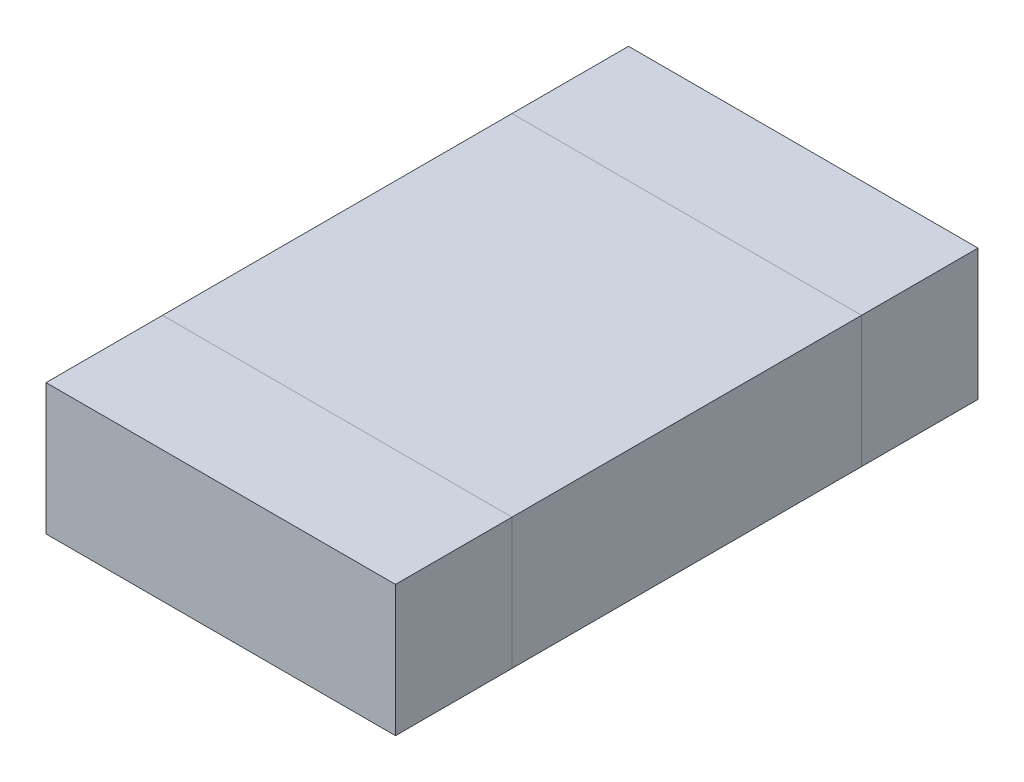
ISO-10303-21;
HEADER;
FILE_DESCRIPTION(('STEP AP214'),'2;1');
FILE_NAME('part.step','',(''),(''),'','','');
FILE_SCHEMA(('AUTOMOTIVE_DESIGN { 1 0 10303 214 1 1 1 1 }'));
ENDSEC;
DATA;
#1=APPLICATION_CONTEXT('core data for automotive mechanical design processes');
#2=APPLICATION_PROTOCOL_DEFINITION('international standard','automotive_design',2000,#1);
#3=PRODUCT_CONTEXT('',#1,'mechanical');
#4=PRODUCT('Part','Part','',(#3));
#5=PRODUCT_RELATED_PRODUCT_CATEGORY('part','',(#4));
#6=PRODUCT_DEFINITION_FORMATION('','',#4);
#7=PRODUCT_DEFINITION_CONTEXT('part definition',#1,'design');
#8=PRODUCT_DEFINITION('design','',#6,#7);
#9=PRODUCT_DEFINITION_SHAPE('','',#8);
#10=(LENGTH_UNIT() NAMED_UNIT(*) SI_UNIT(.MILLI.,.METRE.));
#11=(NAMED_UNIT(*) PLANE_ANGLE_UNIT() SI_UNIT($,.RADIAN.));
#12=(NAMED_UNIT(*) SI_UNIT($,.STERADIAN.) SOLID_ANGLE_UNIT());
#13=UNCERTAINTY_MEASURE_WITH_UNIT(LENGTH_MEASURE(1.E-05),#10,'distance_accuracy_value','');
#14=(GEOMETRIC_REPRESENTATION_CONTEXT(3) GLOBAL_UNCERTAINTY_ASSIGNED_CONTEXT((#13)) GLOBAL_UNIT_ASSIGNED_CONTEXT((#10,
#11,#12)) REPRESENTATION_CONTEXT('',''));
#15=CARTESIAN_POINT('',(0.,0.,0.));
#16=DIRECTION('',(0.,0.,1.));
#17=DIRECTION('',(1.,0.,0.));
#18=AXIS2_PLACEMENT_3D('',#15,#16,#17);
#19=CARTESIAN_POINT('',(-0.6,1.71491106406735,-0.6));
#20=DIRECTION('',(0.,0.,1.));
#21=DIRECTION('',(1.,0.,0.));
#22=AXIS2_PLACEMENT_3D('',#19,#20,#21);
#23=PLANE('',#22);
#24=DIRECTION('',(0.,1.,0.));
#25=VECTOR('',#24,1.);
#26=CARTESIAN_POINT('',(-0.6,1.71491106406735,-0.6));
#27=LINE('',#26,#25);
#28=CARTESIAN_POINT('',(-0.6,0.,-0.6));
#29=VERTEX_POINT('',#28);
#30=CARTESIAN_POINT('',(-0.6,0.45,-0.6));
#31=VERTEX_POINT('',#30);
#32=EDGE_CURVE('P0_E20',#29,#31,#27,.T.);
#33=ORIENTED_EDGE('',*,*,#32,.F.);
#34=DIRECTION('',(1.,0.,0.));
#35=VECTOR('',#34,1.);
#36=CARTESIAN_POINT('',(0.,0.,-0.6));
#37=LINE('',#36,#35);
#38=CARTESIAN_POINT('',(0.6,0.,-0.6));
#39=VERTEX_POINT('',#38);
#40=EDGE_CURVE('P0_E81',#39,#29,#37,.F.);
#41=ORIENTED_EDGE('',*,*,#40,.F.);
#42=DIRECTION('',(0.,1.,0.));
#43=VECTOR('',#42,1.);
#44=CARTESIAN_POINT('',(0.6,1.71491106406735,-0.6));
#45=LINE('',#44,#43);
#46=CARTESIAN_POINT('',(0.6,0.45,-0.6));
#47=VERTEX_POINT('',#46);
#48=EDGE_CURVE('P0_E68',#47,#39,#45,.F.);
#49=ORIENTED_EDGE('',*,*,#48,.F.);
#50=DIRECTION('',(1.,0.,0.));
#51=VECTOR('',#50,1.);
#52=CARTESIAN_POINT('',(0.,0.45,-0.6));
#53=LINE('',#52,#51);
#54=EDGE_CURVE('P0_E55',#31,#47,#53,.T.);
#55=ORIENTED_EDGE('',*,*,#54,.F.);
#56=EDGE_LOOP('',(#33,#41,#49,#55));
#57=FACE_BOUND('',#56,.T.);
#58=ADVANCED_FACE('P0_F17',(#57),#23,.T.);
#59=CARTESIAN_POINT('',(-0.6,1.71491106406735,-0.6));
#60=DIRECTION('',(-1.,0.,0.));
#61=DIRECTION('',(0.,0.,1.));
#62=AXIS2_PLACEMENT_3D('',#59,#60,#61);
#63=PLANE('',#62);
#64=DIRECTION('',(0.,1.,0.));
#65=VECTOR('',#64,1.);
#66=CARTESIAN_POINT('',(-0.6,1.71491106406735,-1.));
#67=LINE('',#66,#65);
#68=CARTESIAN_POINT('',(-0.6,0.,-1.));
#69=VERTEX_POINT('',#68);
#70=CARTESIAN_POINT('',(-0.6,0.45,-1.));
#71=VERTEX_POINT('',#70);
#72=EDGE_CURVE('P0_E83',#69,#71,#67,.T.);
#73=ORIENTED_EDGE('',*,*,#72,.F.);
#74=DIRECTION('',(0.,0.,-1.));
#75=VECTOR('',#74,1.);
#76=CARTESIAN_POINT('',(-0.6,0.,0.));
#77=LINE('',#76,#75);
#78=EDGE_CURVE('P0_E64',#29,#69,#77,.T.);
#79=ORIENTED_EDGE('',*,*,#78,.F.);
#80=ORIENTED_EDGE('',*,*,#32,.T.);
#81=DIRECTION('',(0.,0.,1.));
#82=VECTOR('',#81,1.);
#83=CARTESIAN_POINT('',(-0.6,0.45,0.));
#84=LINE('',#83,#82);
#85=EDGE_CURVE('P0_E61',#71,#31,#84,.T.);
#86=ORIENTED_EDGE('',*,*,#85,.F.);
#87=EDGE_LOOP('',(#73,#79,#80,#86));
#88=FACE_BOUND('',#87,.T.);
#89=ADVANCED_FACE('P0_F60',(#88),#63,.T.);
#90=CARTESIAN_POINT('',(0.,0.45,0.));
#91=DIRECTION('',(0.,1.,0.));
#92=DIRECTION('',(0.,0.,1.));
#93=AXIS2_PLACEMENT_3D('',#90,#91,#92);
#94=PLANE('',#93);
#95=DIRECTION('',(0.,0.,-1.));
#96=VECTOR('',#95,1.);
#97=CARTESIAN_POINT('',(0.6,0.45,-0.6));
#98=LINE('',#97,#96);
#99=CARTESIAN_POINT('',(0.6,0.45,-1.));
#100=VERTEX_POINT('',#99);
#101=EDGE_CURVE('P0_E70',#100,#47,#98,.F.);
#102=ORIENTED_EDGE('',*,*,#101,.F.);
#103=DIRECTION('',(-1.,0.,0.));
#104=VECTOR('',#103,1.);
#105=CARTESIAN_POINT('',(-0.6,0.45,-1.));
#106=LINE('',#105,#104);
#107=EDGE_CURVE('P0_E74',#71,#100,#106,.F.);
#108=ORIENTED_EDGE('',*,*,#107,.F.);
#109=ORIENTED_EDGE('',*,*,#85,.T.);
#110=ORIENTED_EDGE('',*,*,#54,.T.);
#111=EDGE_LOOP('',(#102,#108,#109,#110));
#112=FACE_BOUND('',#111,.T.);
#113=ADVANCED_FACE('P0_F72',(#112),#94,.T.);
#114=CARTESIAN_POINT('',(0.6,1.71491106406735,-0.6));
#115=DIRECTION('',(1.,0.,0.));
#116=DIRECTION('',(0.,0.,-1.));
#117=AXIS2_PLACEMENT_3D('',#114,#115,#116);
#118=PLANE('',#117);
#119=ORIENTED_EDGE('',*,*,#48,.T.);
#120=DIRECTION('',(0.,0.,-1.));
#121=VECTOR('',#120,1.);
#122=CARTESIAN_POINT('',(0.6,0.,0.));
#123=LINE('',#122,#121);
#124=CARTESIAN_POINT('',(0.6,0.,-1.));
#125=VERTEX_POINT('',#124);
#126=EDGE_CURVE('P0_E35',#125,#39,#123,.F.);
#127=ORIENTED_EDGE('',*,*,#126,.F.);
#128=DIRECTION('',(0.,1.,0.));
#129=VECTOR('',#128,1.);
#130=CARTESIAN_POINT('',(0.6,1.71491106406735,-1.));
#131=LINE('',#130,#129);
#132=EDGE_CURVE('P0_E26',#100,#125,#131,.F.);
#133=ORIENTED_EDGE('',*,*,#132,.F.);
#134=ORIENTED_EDGE('',*,*,#101,.T.);
#135=EDGE_LOOP('',(#119,#127,#133,#134));
#136=FACE_BOUND('',#135,.T.);
#137=ADVANCED_FACE('P0_F89',(#136),#118,.T.);
#138=CARTESIAN_POINT('',(0.,0.,0.));
#139=DIRECTION('',(0.,-1.,0.));
#140=DIRECTION('',(0.,0.,-1.));
#141=AXIS2_PLACEMENT_3D('',#138,#139,#140);
#142=PLANE('',#141);
#143=ORIENTED_EDGE('',*,*,#126,.T.);
#144=ORIENTED_EDGE('',*,*,#40,.T.);
#145=ORIENTED_EDGE('',*,*,#78,.T.);
#146=DIRECTION('',(-1.,0.,0.));
#147=VECTOR('',#146,1.);
#148=CARTESIAN_POINT('',(-0.6,0.,-1.));
#149=LINE('',#148,#147);
#150=EDGE_CURVE('P0_E11',#125,#69,#149,.T.);
#151=ORIENTED_EDGE('',*,*,#150,.F.);
#152=EDGE_LOOP('',(#143,#144,#145,#151));
#153=FACE_BOUND('',#152,.T.);
#154=ADVANCED_FACE('P0_F91',(#153),#142,.T.);
#155=CARTESIAN_POINT('',(-0.6,1.71491106406735,-1.));
#156=DIRECTION('',(0.,0.,-1.));
#157=DIRECTION('',(-1.,0.,0.));
#158=AXIS2_PLACEMENT_3D('',#155,#156,#157);
#159=PLANE('',#158);
#160=ORIENTED_EDGE('',*,*,#132,.T.);
#161=ORIENTED_EDGE('',*,*,#150,.T.);
#162=ORIENTED_EDGE('',*,*,#72,.T.);
#163=ORIENTED_EDGE('',*,*,#107,.T.);
#164=EDGE_LOOP('',(#160,#161,#162,#163));
#165=FACE_BOUND('',#164,.T.);
#166=ADVANCED_FACE('P0_F88',(#165),#159,.T.);
#167=CLOSED_SHELL('',(#58,#89,#113,#137,#154,#166));
#168=MANIFOLD_SOLID_BREP('P0_B1',#167);
#169=CARTESIAN_POINT('',(-0.6,1.71491106406735,1.));
#170=DIRECTION('',(0.,0.,1.));
#171=DIRECTION('',(1.,0.,0.));
#172=AXIS2_PLACEMENT_3D('',#169,#170,#171);
#173=PLANE('',#172);
#174=DIRECTION('',(0.,1.,0.));
#175=VECTOR('',#174,1.);
#176=CARTESIAN_POINT('',(-0.6,1.71491106406735,1.));
#177=LINE('',#176,#175);
#178=CARTESIAN_POINT('',(-0.6,0.,1.));
#179=VERTEX_POINT('',#178);
#180=CARTESIAN_POINT('',(-0.6,0.45,1.));
#181=VERTEX_POINT('',#180);
#182=EDGE_CURVE('P1_E20',#179,#181,#177,.T.);
#183=ORIENTED_EDGE('',*,*,#182,.F.);
#184=DIRECTION('',(1.,0.,0.));
#185=VECTOR('',#184,1.);
#186=CARTESIAN_POINT('',(0.,0.,1.));
#187=LINE('',#186,#185);
#188=CARTESIAN_POINT('',(0.6,0.,1.));
#189=VERTEX_POINT('',#188);
#190=EDGE_CURVE('P1_E79',#179,#189,#187,.T.);
#191=ORIENTED_EDGE('',*,*,#190,.T.);
#192=DIRECTION('',(0.,1.,0.));
#193=VECTOR('',#192,1.);
#194=CARTESIAN_POINT('',(0.6,1.71491106406735,1.));
#195=LINE('',#194,#193);
#196=CARTESIAN_POINT('',(0.6,0.45,1.));
#197=VERTEX_POINT('',#196);
#198=EDGE_CURVE('P1_E68',#197,#189,#195,.F.);
#199=ORIENTED_EDGE('',*,*,#198,.F.);
#200=DIRECTION('',(1.,0.,0.));
#201=VECTOR('',#200,1.);
#202=CARTESIAN_POINT('',(0.,0.45,1.));
#203=LINE('',#202,#201);
#204=EDGE_CURVE('P1_E56',#181,#197,#203,.T.);
#205=ORIENTED_EDGE('',*,*,#204,.F.);
#206=EDGE_LOOP('',(#183,#191,#199,#205));
#207=FACE_BOUND('',#206,.T.);
#208=ADVANCED_FACE('P1_F17',(#207),#173,.T.);
#209=CARTESIAN_POINT('',(-0.6,1.71491106406735,0.6));
#210=DIRECTION('',(-1.,0.,0.));
#211=DIRECTION('',(0.,0.,1.));
#212=AXIS2_PLACEMENT_3D('',#209,#210,#211);
#213=PLANE('',#212);
#214=DIRECTION('',(0.,1.,0.));
#215=VECTOR('',#214,1.);
#216=CARTESIAN_POINT('',(-0.6,1.71491106406735,0.6));
#217=LINE('',#216,#215);
#218=CARTESIAN_POINT('',(-0.6,0.,0.6));
#219=VERTEX_POINT('',#218);
#220=CARTESIAN_POINT('',(-0.6,0.45,0.6));
#221=VERTEX_POINT('',#220);
#222=EDGE_CURVE('P1_E83',#219,#221,#217,.T.);
#223=ORIENTED_EDGE('',*,*,#222,.F.);
#224=DIRECTION('',(0.,0.,1.));
#225=VECTOR('',#224,1.);
#226=CARTESIAN_POINT('',(-0.6,0.,0.));
#227=LINE('',#226,#225);
#228=EDGE_CURVE('P1_E65',#219,#179,#227,.T.);
#229=ORIENTED_EDGE('',*,*,#228,.T.);
#230=ORIENTED_EDGE('',*,*,#182,.T.);
#231=DIRECTION('',(0.,0.,1.));
#232=VECTOR('',#231,1.);
#233=CARTESIAN_POINT('',(-0.6,0.45,0.));
#234=LINE('',#233,#232);
#235=EDGE_CURVE('P1_E62',#221,#181,#234,.T.);
#236=ORIENTED_EDGE('',*,*,#235,.F.);
#237=EDGE_LOOP('',(#223,#229,#230,#236));
#238=FACE_BOUND('',#237,.T.);
#239=ADVANCED_FACE('P1_F61',(#238),#213,.T.);
#240=CARTESIAN_POINT('',(0.,0.45,0.));
#241=DIRECTION('',(0.,1.,0.));
#242=DIRECTION('',(0.,0.,1.));
#243=AXIS2_PLACEMENT_3D('',#240,#241,#242);
#244=PLANE('',#243);
#245=DIRECTION('',(0.,0.,-1.));
#246=VECTOR('',#245,1.);
#247=CARTESIAN_POINT('',(0.6,0.45,0.6));
#248=LINE('',#247,#246);
#249=CARTESIAN_POINT('',(0.6,0.45,0.6));
#250=VERTEX_POINT('',#249);
#251=EDGE_CURVE('P1_E70',#250,#197,#248,.F.);
#252=ORIENTED_EDGE('',*,*,#251,.F.);
#253=DIRECTION('',(-1.,0.,0.));
#254=VECTOR('',#253,1.);
#255=CARTESIAN_POINT('',(-0.6,0.45,0.6));
#256=LINE('',#255,#254);
#257=EDGE_CURVE('P1_E74',#221,#250,#256,.F.);
#258=ORIENTED_EDGE('',*,*,#257,.F.);
#259=ORIENTED_EDGE('',*,*,#235,.T.);
#260=ORIENTED_EDGE('',*,*,#204,.T.);
#261=EDGE_LOOP('',(#252,#258,#259,#260));
#262=FACE_BOUND('',#261,.T.);
#263=ADVANCED_FACE('P1_F72',(#262),#244,.T.);
#264=CARTESIAN_POINT('',(0.6,1.71491106406735,0.6));
#265=DIRECTION('',(1.,0.,0.));
#266=DIRECTION('',(0.,0.,-1.));
#267=AXIS2_PLACEMENT_3D('',#264,#265,#266);
#268=PLANE('',#267);
#269=ORIENTED_EDGE('',*,*,#198,.T.);
#270=DIRECTION('',(0.,0.,1.));
#271=VECTOR('',#270,1.);
#272=CARTESIAN_POINT('',(0.6,0.,0.));
#273=LINE('',#272,#271);
#274=CARTESIAN_POINT('',(0.6,0.,0.6));
#275=VERTEX_POINT('',#274);
#276=EDGE_CURVE('P1_E35',#189,#275,#273,.F.);
#277=ORIENTED_EDGE('',*,*,#276,.T.);
#278=DIRECTION('',(0.,1.,0.));
#279=VECTOR('',#278,1.);
#280=CARTESIAN_POINT('',(0.6,1.71491106406735,0.6));
#281=LINE('',#280,#279);
#282=EDGE_CURVE('P1_E26',#250,#275,#281,.F.);
#283=ORIENTED_EDGE('',*,*,#282,.F.);
#284=ORIENTED_EDGE('',*,*,#251,.T.);
#285=EDGE_LOOP('',(#269,#277,#283,#284));
#286=FACE_BOUND('',#285,.T.);
#287=ADVANCED_FACE('P1_F89',(#286),#268,.T.);
#288=CARTESIAN_POINT('',(0.,0.,0.));
#289=DIRECTION('',(0.,1.,0.));
#290=DIRECTION('',(0.,0.,1.));
#291=AXIS2_PLACEMENT_3D('',#288,#289,#290);
#292=PLANE('',#291);
#293=DIRECTION('',(-1.,0.,0.));
#294=VECTOR('',#293,1.);
#295=CARTESIAN_POINT('',(-0.6,0.,0.6));
#296=LINE('',#295,#294);
#297=EDGE_CURVE('P1_E11',#275,#219,#296,.T.);
#298=ORIENTED_EDGE('',*,*,#297,.F.);
#299=ORIENTED_EDGE('',*,*,#276,.F.);
#300=ORIENTED_EDGE('',*,*,#190,.F.);
#301=ORIENTED_EDGE('',*,*,#228,.F.);
#302=EDGE_LOOP('',(#298,#299,#300,#301));
#303=FACE_BOUND('',#302,.T.);
#304=ADVANCED_FACE('P1_F91',(#303),#292,.F.);
#305=CARTESIAN_POINT('',(-0.6,1.71491106406735,0.6));
#306=DIRECTION('',(0.,0.,-1.));
#307=DIRECTION('',(-1.,0.,0.));
#308=AXIS2_PLACEMENT_3D('',#305,#306,#307);
#309=PLANE('',#308);
#310=ORIENTED_EDGE('',*,*,#282,.T.);
#311=ORIENTED_EDGE('',*,*,#297,.T.);
#312=ORIENTED_EDGE('',*,*,#222,.T.);
#313=ORIENTED_EDGE('',*,*,#257,.T.);
#314=EDGE_LOOP('',(#310,#311,#312,#313));
#315=FACE_BOUND('',#314,.T.);
#316=ADVANCED_FACE('P1_F88',(#315),#309,.T.);
#317=CLOSED_SHELL('',(#208,#239,#263,#287,#304,#316));
#318=MANIFOLD_SOLID_BREP('P1_B1',#317);
#319=CARTESIAN_POINT('',(0.,0.,0.));
#320=DIRECTION('',(0.,1.,0.));
#321=DIRECTION('',(0.,0.,1.));
#322=AXIS2_PLACEMENT_3D('',#319,#320,#321);
#323=PLANE('',#322);
#324=DIRECTION('',(-1.,0.,0.));
#325=VECTOR('',#324,1.);
#326=CARTESIAN_POINT('',(-0.6,0.,0.6));
#327=LINE('',#326,#325);
#328=CARTESIAN_POINT('',(0.6,0.,0.6));
#329=VERTEX_POINT('',#328);
#330=CARTESIAN_POINT('',(-0.6,0.,0.6));
#331=VERTEX_POINT('',#330);
#332=EDGE_CURVE('P2_E81',#329,#331,#327,.T.);
#333=ORIENTED_EDGE('',*,*,#332,.T.);
#334=DIRECTION('',(0.,0.,-1.));
#335=VECTOR('',#334,1.);
#336=CARTESIAN_POINT('',(-0.6,0.,-0.6));
#337=LINE('',#336,#335);
#338=CARTESIAN_POINT('',(-0.6,0.,-0.6));
#339=VERTEX_POINT('',#338);
#340=EDGE_CURVE('P2_E68',#331,#339,#337,.T.);
#341=ORIENTED_EDGE('',*,*,#340,.T.);
#342=DIRECTION('',(1.,0.,0.));
#343=VECTOR('',#342,1.);
#344=CARTESIAN_POINT('',(-0.6,0.,-0.6));
#345=LINE('',#344,#343);
#346=CARTESIAN_POINT('',(0.6,0.,-0.6));
#347=VERTEX_POINT('',#346);
#348=EDGE_CURVE('P2_E55',#339,#347,#345,.T.);
#349=ORIENTED_EDGE('',*,*,#348,.T.);
#350=DIRECTION('',(0.,0.,1.));
#351=VECTOR('',#350,1.);
#352=CARTESIAN_POINT('',(0.6,0.,-0.6));
#353=LINE('',#352,#351);
#354=EDGE_CURVE('P2_E20',#347,#329,#353,.T.);
#355=ORIENTED_EDGE('',*,*,#354,.T.);
#356=EDGE_LOOP('',(#333,#341,#349,#355));
#357=FACE_BOUND('',#356,.T.);
#358=ADVANCED_FACE('P2_F17',(#357),#323,.F.);
#359=CARTESIAN_POINT('',(0.6,0.45,-0.6));
#360=DIRECTION('',(-1.,0.,0.));
#361=DIRECTION('',(0.,0.,1.));
#362=AXIS2_PLACEMENT_3D('',#359,#360,#361);
#363=PLANE('',#362);
#364=DIRECTION('',(0.,1.,0.));
#365=VECTOR('',#364,1.);
#366=CARTESIAN_POINT('',(0.6,0.45,-0.6));
#367=LINE('',#366,#365);
#368=CARTESIAN_POINT('',(0.6,0.45,-0.6));
#369=VERTEX_POINT('',#368);
#370=EDGE_CURVE('P2_E61',#347,#369,#367,.T.);
#371=ORIENTED_EDGE('',*,*,#370,.T.);
#372=DIRECTION('',(0.,0.,1.));
#373=VECTOR('',#372,1.);
#374=CARTESIAN_POINT('',(0.6,0.45,0.));
#375=LINE('',#374,#373);
#376=CARTESIAN_POINT('',(0.6,0.45,0.6));
#377=VERTEX_POINT('',#376);
#378=EDGE_CURVE('P2_E83',#377,#369,#375,.F.);
#379=ORIENTED_EDGE('',*,*,#378,.F.);
#380=DIRECTION('',(0.,1.,0.));
#381=VECTOR('',#380,1.);
#382=CARTESIAN_POINT('',(0.6,0.45,0.6));
#383=LINE('',#382,#381);
#384=EDGE_CURVE('P2_E64',#377,#329,#383,.F.);
#385=ORIENTED_EDGE('',*,*,#384,.T.);
#386=ORIENTED_EDGE('',*,*,#354,.F.);
#387=EDGE_LOOP('',(#371,#379,#385,#386));
#388=FACE_BOUND('',#387,.T.);
#389=ADVANCED_FACE('P2_F60',(#388),#363,.F.);
#390=CARTESIAN_POINT('',(-0.6,0.45,-0.6));
#391=DIRECTION('',(0.,0.,1.));
#392=DIRECTION('',(1.,0.,0.));
#393=AXIS2_PLACEMENT_3D('',#390,#391,#392);
#394=PLANE('',#393);
#395=DIRECTION('',(0.,1.,0.));
#396=VECTOR('',#395,1.);
#397=CARTESIAN_POINT('',(-0.6,0.45,-0.6));
#398=LINE('',#397,#396);
#399=CARTESIAN_POINT('',(-0.6,0.45,-0.6));
#400=VERTEX_POINT('',#399);
#401=EDGE_CURVE('P2_E70',#339,#400,#398,.T.);
#402=ORIENTED_EDGE('',*,*,#401,.T.);
#403=DIRECTION('',(1.,0.,0.));
#404=VECTOR('',#403,1.);
#405=CARTESIAN_POINT('',(0.,0.45,-0.6));
#406=LINE('',#405,#404);
#407=EDGE_CURVE('P2_E74',#369,#400,#406,.F.);
#408=ORIENTED_EDGE('',*,*,#407,.F.);
#409=ORIENTED_EDGE('',*,*,#370,.F.);
#410=ORIENTED_EDGE('',*,*,#348,.F.);
#411=EDGE_LOOP('',(#402,#408,#409,#410));
#412=FACE_BOUND('',#411,.T.);
#413=ADVANCED_FACE('P2_F72',(#412),#394,.F.);
#414=CARTESIAN_POINT('',(-0.6,0.45,-0.6));
#415=DIRECTION('',(1.,0.,0.));
#416=DIRECTION('',(0.,0.,-1.));
#417=AXIS2_PLACEMENT_3D('',#414,#415,#416);
#418=PLANE('',#417);
#419=DIRECTION('',(0.,1.,0.));
#420=VECTOR('',#419,1.);
#421=CARTESIAN_POINT('',(-0.6,0.45,0.6));
#422=LINE('',#421,#420);
#423=CARTESIAN_POINT('',(-0.6,0.45,0.6));
#424=VERTEX_POINT('',#423);
#425=EDGE_CURVE('P2_E35',#331,#424,#422,.T.);
#426=ORIENTED_EDGE('',*,*,#425,.T.);
#427=DIRECTION('',(0.,0.,1.));
#428=VECTOR('',#427,1.);
#429=CARTESIAN_POINT('',(-0.6,0.45,0.));
#430=LINE('',#429,#428);
#431=EDGE_CURVE('P2_E26',#400,#424,#430,.T.);
#432=ORIENTED_EDGE('',*,*,#431,.F.);
#433=ORIENTED_EDGE('',*,*,#401,.F.);
#434=ORIENTED_EDGE('',*,*,#340,.F.);
#435=EDGE_LOOP('',(#426,#432,#433,#434));
#436=FACE_BOUND('',#435,.T.);
#437=ADVANCED_FACE('P2_F89',(#436),#418,.F.);
#438=CARTESIAN_POINT('',(-0.6,0.45,0.6));
#439=DIRECTION('',(0.,0.,-1.));
#440=DIRECTION('',(-1.,0.,0.));
#441=AXIS2_PLACEMENT_3D('',#438,#439,#440);
#442=PLANE('',#441);
#443=ORIENTED_EDGE('',*,*,#384,.F.);
#444=DIRECTION('',(1.,0.,0.));
#445=VECTOR('',#444,1.);
#446=CARTESIAN_POINT('',(0.,0.45,0.6));
#447=LINE('',#446,#445);
#448=EDGE_CURVE('P2_E11',#424,#377,#447,.T.);
#449=ORIENTED_EDGE('',*,*,#448,.F.);
#450=ORIENTED_EDGE('',*,*,#425,.F.);
#451=ORIENTED_EDGE('',*,*,#332,.F.);
#452=EDGE_LOOP('',(#443,#449,#450,#451));
#453=FACE_BOUND('',#452,.T.);
#454=ADVANCED_FACE('P2_F91',(#453),#442,.F.);
#455=CARTESIAN_POINT('',(0.,0.45,0.));
#456=DIRECTION('',(0.,1.,0.));
#457=DIRECTION('',(0.,0.,1.));
#458=AXIS2_PLACEMENT_3D('',#455,#456,#457);
#459=PLANE('',#458);
#460=ORIENTED_EDGE('',*,*,#431,.T.);
#461=ORIENTED_EDGE('',*,*,#448,.T.);
#462=ORIENTED_EDGE('',*,*,#378,.T.);
#463=ORIENTED_EDGE('',*,*,#407,.T.);
#464=EDGE_LOOP('',(#460,#461,#462,#463));
#465=FACE_BOUND('',#464,.T.);
#466=ADVANCED_FACE('P2_F88',(#465),#459,.T.);
#467=CLOSED_SHELL('',(#358,#389,#413,#437,#454,#466));
#468=MANIFOLD_SOLID_BREP('P2_B1',#467);
#469=ADVANCED_BREP_SHAPE_REPRESENTATION('',(#18,#168,#318,#468),#14);
#470=SHAPE_DEFINITION_REPRESENTATION(#9,#469);
ENDSEC;
END-ISO-10303-21;
